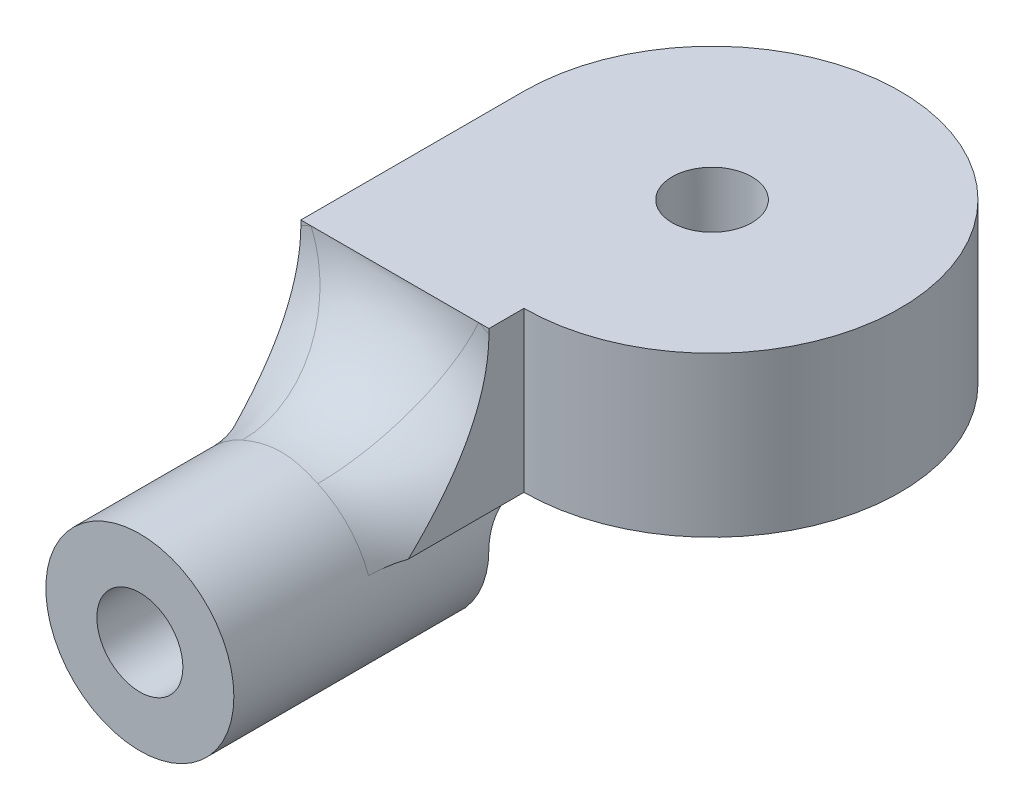
ISO-10303-21;
HEADER;
FILE_DESCRIPTION(('STEP AP214'),'2;1');
FILE_NAME('part.step','',(''),(''),'','','');
FILE_SCHEMA(('AUTOMOTIVE_DESIGN { 1 0 10303 214 1 1 1 1 }'));
ENDSEC;
DATA;
#1=APPLICATION_CONTEXT('core data for automotive mechanical design processes');
#2=APPLICATION_PROTOCOL_DEFINITION('international standard','automotive_design',2000,#1);
#3=PRODUCT_CONTEXT('',#1,'mechanical');
#4=PRODUCT('Part','Part','',(#3));
#5=PRODUCT_RELATED_PRODUCT_CATEGORY('part','',(#4));
#6=PRODUCT_DEFINITION_FORMATION('','',#4);
#7=PRODUCT_DEFINITION_CONTEXT('part definition',#1,'design');
#8=PRODUCT_DEFINITION('design','',#6,#7);
#9=PRODUCT_DEFINITION_SHAPE('','',#8);
#10=(LENGTH_UNIT() NAMED_UNIT(*) SI_UNIT(.MILLI.,.METRE.));
#11=(NAMED_UNIT(*) PLANE_ANGLE_UNIT() SI_UNIT($,.RADIAN.));
#12=(NAMED_UNIT(*) SI_UNIT($,.STERADIAN.) SOLID_ANGLE_UNIT());
#13=UNCERTAINTY_MEASURE_WITH_UNIT(LENGTH_MEASURE(1.E-05),#10,'distance_accuracy_value','');
#14=(GEOMETRIC_REPRESENTATION_CONTEXT(3) GLOBAL_UNCERTAINTY_ASSIGNED_CONTEXT((#13)) GLOBAL_UNIT_ASSIGNED_CONTEXT((#10,
#11,#12)) REPRESENTATION_CONTEXT('',''));
#15=CARTESIAN_POINT('',(0.,0.,0.));
#16=DIRECTION('',(0.,0.,1.));
#17=DIRECTION('',(1.,0.,0.));
#18=AXIS2_PLACEMENT_3D('',#15,#16,#17);
#19=CARTESIAN_POINT('',(0.,7.62,0.));
#20=DIRECTION('',(0.,0.,1.));
#21=DIRECTION('',(1.,0.,0.));
#22=AXIS2_PLACEMENT_3D('',#19,#20,#21);
#23=PLANE('',#22);
#24=DIRECTION('',(0.,-1.,0.));
#25=VECTOR('',#24,1.);
#26=CARTESIAN_POINT('',(-3.7465,7.62,0.));
#27=LINE('',#26,#25);
#28=CARTESIAN_POINT('',(-3.7465,7.62,0.));
#29=VERTEX_POINT('',#28);
#30=CARTESIAN_POINT('',(-3.7465,7.42705729074443,0.));
#31=VERTEX_POINT('',#30);
#32=EDGE_CURVE('E183',#29,#31,#27,.T.);
#33=ORIENTED_EDGE('',*,*,#32,.T.);
#34=CARTESIAN_POINT('',(0.,0.,0.));
#35=DIRECTION('',(0.,0.,1.));
#36=DIRECTION('',(1.,0.,0.));
#37=AXIS2_PLACEMENT_3D('',#34,#35,#36);
#38=CIRCLE('',#37,8.3185);
#39=CARTESIAN_POINT('',(-3.33662138247659,7.62,0.));
#40=VERTEX_POINT('',#39);
#41=EDGE_CURVE('E531',#31,#40,#38,.F.);
#42=ORIENTED_EDGE('',*,*,#41,.T.);
#43=DIRECTION('',(-1.,0.,0.));
#44=VECTOR('',#43,1.);
#45=CARTESIAN_POINT('',(0.,7.62,0.));
#46=LINE('',#45,#44);
#47=EDGE_CURVE('E172',#40,#29,#46,.T.);
#48=ORIENTED_EDGE('',*,*,#47,.T.);
#49=EDGE_LOOP('',(#33,#42,#48));
#50=FACE_BOUND('',#49,.T.);
#51=ADVANCED_FACE('F37',(#50),#23,.T.);
#52=CARTESIAN_POINT('',(0.,0.,0.));
#53=DIRECTION('',(0.,0.,1.));
#54=DIRECTION('',(1.,0.,0.));
#55=AXIS2_PLACEMENT_3D('',#52,#53,#54);
#56=PLANE('',#55);
#57=CARTESIAN_POINT('',(0.,0.,0.));
#58=DIRECTION('',(0.,0.,1.));
#59=DIRECTION('',(1.,0.,0.));
#60=AXIS2_PLACEMENT_3D('',#57,#58,#59);
#61=CIRCLE('',#60,3.7465);
#62=CARTESIAN_POINT('',(-3.7465,0.,0.));
#63=VERTEX_POINT('',#62);
#64=CARTESIAN_POINT('',(3.7465,0.,0.));
#65=VERTEX_POINT('',#64);
#66=EDGE_CURVE('E190',#63,#65,#61,.T.);
#67=ORIENTED_EDGE('',*,*,#66,.F.);
#68=DIRECTION('',(-1.,0.,0.));
#69=VECTOR('',#68,1.);
#70=CARTESIAN_POINT('',(-1.15178567884828,0.,0.));
#71=LINE('',#70,#69);
#72=CARTESIAN_POINT('',(-1.7145,0.,0.));
#73=VERTEX_POINT('',#72);
#74=EDGE_CURVE('E305',#63,#73,#71,.F.);
#75=ORIENTED_EDGE('',*,*,#74,.T.);
#76=CARTESIAN_POINT('',(0.,0.,0.));
#77=DIRECTION('',(0.,0.,1.));
#78=DIRECTION('',(1.,0.,0.));
#79=AXIS2_PLACEMENT_3D('',#76,#77,#78);
#80=CIRCLE('',#79,1.7145);
#81=CARTESIAN_POINT('',(1.7145,0.,0.));
#82=VERTEX_POINT('',#81);
#83=EDGE_CURVE('E149',#73,#82,#80,.T.);
#84=ORIENTED_EDGE('',*,*,#83,.T.);
#85=DIRECTION('',(-1.,0.,0.));
#86=VECTOR('',#85,1.);
#87=CARTESIAN_POINT('',(3.52467902793999,0.,0.));
#88=LINE('',#87,#86);
#89=EDGE_CURVE('E309',#82,#65,#88,.F.);
#90=ORIENTED_EDGE('',*,*,#89,.T.);
#91=EDGE_LOOP('',(#67,#75,#84,#90));
#92=FACE_BOUND('',#91,.T.);
#93=ADVANCED_FACE('F358',(#92),#56,.F.);
#94=CARTESIAN_POINT('',(0.,0.,10.16));
#95=DIRECTION('',(0.,0.,1.));
#96=DIRECTION('',(1.,0.,0.));
#97=AXIS2_PLACEMENT_3D('',#94,#95,#96);
#98=PLANE('',#97);
#99=CARTESIAN_POINT('',(0.,0.,10.16));
#100=DIRECTION('',(0.,0.,1.));
#101=DIRECTION('',(1.,0.,0.));
#102=AXIS2_PLACEMENT_3D('',#99,#100,#101);
#103=CIRCLE('',#102,3.7465);
#104=CARTESIAN_POINT('',(3.7465,0.,10.16));
#105=VERTEX_POINT('',#104);
#106=EDGE_CURVE('E194',#105,#105,#103,.T.);
#107=ORIENTED_EDGE('',*,*,#106,.T.);
#108=EDGE_LOOP('',(#107));
#109=FACE_BOUND('',#108,.T.);
#110=CARTESIAN_POINT('',(0.,0.,10.16));
#111=DIRECTION('',(0.,0.,1.));
#112=DIRECTION('',(1.,0.,0.));
#113=AXIS2_PLACEMENT_3D('',#110,#111,#112);
#114=CIRCLE('',#113,1.7145);
#115=CARTESIAN_POINT('',(1.7145,0.,10.16));
#116=VERTEX_POINT('',#115);
#117=EDGE_CURVE('E187',#116,#116,#114,.T.);
#118=ORIENTED_EDGE('',*,*,#117,.F.);
#119=EDGE_LOOP('',(#118));
#120=FACE_BOUND('',#119,.T.);
#121=ADVANCED_FACE('F292',(#109,#120),#98,.T.);
#122=CARTESIAN_POINT('',(0.,0.,10.16));
#123=DIRECTION('',(0.,0.,-1.));
#124=DIRECTION('',(-1.,0.,0.));
#125=AXIS2_PLACEMENT_3D('',#122,#123,#124);
#126=CYLINDRICAL_SURFACE('',#125,3.7465);
#127=ORIENTED_EDGE('',*,*,#106,.F.);
#128=EDGE_LOOP('',(#127));
#129=FACE_BOUND('',#128,.T.);
#130=CARTESIAN_POINT('',(0.,0.,4.572));
#131=DIRECTION('',(0.,0.,1.));
#132=DIRECTION('',(1.,0.,0.));
#133=AXIS2_PLACEMENT_3D('',#130,#131,#132);
#134=CIRCLE('',#133,3.7465);
#135=CARTESIAN_POINT('',(-1.5027531417261,3.43190839694656,4.572));
#136=VERTEX_POINT('',#135);
#137=CARTESIAN_POINT('',(-3.52467902793999,1.27,4.572));
#138=VERTEX_POINT('',#137);
#139=EDGE_CURVE('E213',#136,#138,#134,.T.);
#140=ORIENTED_EDGE('',*,*,#139,.T.);
#141=DIRECTION('',(0.,0.,-1.));
#142=VECTOR('',#141,1.);
#143=CARTESIAN_POINT('',(-3.52467902793999,1.27,4.572));
#144=LINE('',#143,#142);
#145=CARTESIAN_POINT('',(-3.52467902793999,1.27,-1.27));
#146=VERTEX_POINT('',#145);
#147=EDGE_CURVE('E530',#138,#146,#144,.T.);
#148=ORIENTED_EDGE('',*,*,#147,.T.);
#149=CARTESIAN_POINT('',(-3.52467902793999,1.27,-1.27));
#150=CARTESIAN_POINT('',(-3.52467551141979,1.2700009902898,-1.23537706976724));
#151=CARTESIAN_POINT('',(-3.5251898251675,1.26858324531154,-1.20077185710846));
#152=CARTESIAN_POINT('',(-3.52721846548378,1.26293533176767,-1.1318307135482));
#153=CARTESIAN_POINT('',(-3.52873251368593,1.25870594607407,-1.09749471038007));
#154=CARTESIAN_POINT('',(-3.53470538398453,1.24188141013375,-0.995483295649385));
#155=CARTESIAN_POINT('',(-3.54059549873313,1.2251494088276,-0.928525615265789));
#156=CARTESIAN_POINT('',(-3.55547625006654,1.18126176661794,-0.798587402711958));
#157=CARTESIAN_POINT('',(-3.56446511769491,1.15411207176918,-0.735604625641566));
#158=CARTESIAN_POINT('',(-3.58452374617743,1.09021571623752,-0.615028828309147));
#159=CARTESIAN_POINT('',(-3.59559491323332,1.05346256365739,-0.557439489899789));
#160=CARTESIAN_POINT('',(-3.61906738128541,0.969826608964907,-0.44701267291083));
#161=CARTESIAN_POINT('',(-3.63150248662518,0.92262298171232,-0.39442542955397));
#162=CARTESIAN_POINT('',(-3.65601756421701,0.820104914392189,-0.297738138240444));
#163=CARTESIAN_POINT('',(-3.66809746364169,0.764788824766774,-0.253639820617659));
#164=CARTESIAN_POINT('',(-3.6909390069222,0.645754920040908,-0.17402259835627));
#165=CARTESIAN_POINT('',(-3.70165542465871,0.581848326967486,-0.138772081287993));
#166=CARTESIAN_POINT('',(-3.72015079511388,0.448608604553651,-0.0796425699676043));
#167=CARTESIAN_POINT('',(-3.727932556751,0.379280741355271,-0.0557526960811878));
#168=CARTESIAN_POINT('',(-3.73794300200657,0.258044692354971,-0.0254120631196584));
#169=CARTESIAN_POINT('',(-3.74112963512447,0.206960099295953,-0.0159061848732914));
#170=CARTESIAN_POINT('',(-3.74541812740578,0.103928311432396,-0.00319151700517364));
#171=CARTESIAN_POINT('',(-3.74651995734204,0.0519811045450511,1.71843355921098E-05));
#172=CARTESIAN_POINT('',(-3.7465,0.,0.));
#173=B_SPLINE_CURVE_WITH_KNOTS('',3,(#149,#150,#151,#152,#153,#154,#155,#156,#157,#158,#159,
#160,#161,#162,#163,#164,#165,#166,#167,#168,#169,#170,#171,#172),.UNSPECIFIED.,.F.,.F.,(4,2,2,
2,2,2,2,2,2,2,2,4),(0.,0.103801405808098,0.207573921296298,0.414293544442592,0.620895354349748,
0.827637189168036,1.04192669238821,1.25625982900608,1.47646967744981,1.69646821289661,
1.85223702321786,2.00800801726778),.UNSPECIFIED.);
#174=EDGE_CURVE('E303',#146,#63,#173,.T.);
#175=ORIENTED_EDGE('',*,*,#174,.T.);
#176=ORIENTED_EDGE('',*,*,#66,.T.);
#177=CARTESIAN_POINT('',(3.7465,0.,0.));
#178=CARTESIAN_POINT('',(3.74650260117182,0.0346808764586416,8.36462003249203E-07));
#179=CARTESIAN_POINT('',(3.74601787439513,0.069344238595329,-0.0014215116955115));
#180=CARTESIAN_POINT('',(3.7441015662107,0.138405049822375,-0.00708876228888397));
#181=CARTESIAN_POINT('',(3.74267020737296,0.172802559496556,-0.0113330012493434));
#182=CARTESIAN_POINT('',(3.7370115851823,0.275020471103634,-0.0282218612655205));
#183=CARTESIAN_POINT('',(3.73141935821552,0.342127579497861,-0.0450230459974732));
#184=CARTESIAN_POINT('',(3.71718027089636,0.472373835625486,-0.0891117377810754));
#185=CARTESIAN_POINT('',(3.70853457486629,0.535514485020284,-0.116395248151192));
#186=CARTESIAN_POINT('',(3.68906617702462,0.65635469437696,-0.180605005794135));
#187=CARTESIAN_POINT('',(3.67824227601802,0.714051231307606,-0.217536568086225));
#188=CARTESIAN_POINT('',(3.65512669221314,0.82437393067404,-0.301361542531086));
#189=CARTESIAN_POINT('',(3.64279917395521,0.87677932311915,-0.348535427216729));
#190=CARTESIAN_POINT('',(3.61825816874598,0.97311129117496,-0.450917326756902));
#191=CARTESIAN_POINT('',(3.60604471852328,1.01703521973261,-0.506127840433574));
#192=CARTESIAN_POINT('',(3.58271257113477,1.09644992733464,-0.625048163284352));
#193=CARTESIAN_POINT('',(3.57163820647491,1.1316451676076,-0.688964668012461));
#194=CARTESIAN_POINT('',(3.55239948563874,1.190667461744,-0.82221850036134));
#195=CARTESIAN_POINT('',(3.54423198790606,1.21450679783531,-0.891549876473136));
#196=CARTESIAN_POINT('',(3.53370927691445,1.24472535838696,-1.01265221825444));
#197=CARTESIAN_POINT('',(3.53035102375469,1.25417794068246,-1.06358874757814));
#198=CARTESIAN_POINT('',(3.52582318061235,1.26682475319856,-1.1663379990158));
#199=CARTESIAN_POINT('',(3.5246540860093,1.27001756691859,-1.21815091676978));
#200=CARTESIAN_POINT('',(3.52467902793999,1.27,-1.27));
#201=B_SPLINE_CURVE_WITH_KNOTS('',3,(#177,#178,#179,#180,#181,#182,#183,#184,#185,#186,#187,
#188,#189,#190,#191,#192,#193,#194,#195,#196,#197,#198,#199,#200),.UNSPECIFIED.,.F.,.F.,(4,2,2,
2,2,2,2,2,2,2,2,4),(0.,0.103975807805818,0.207927177739375,0.4150563426526,0.622106611992641,
0.829271184753287,1.04305170250601,1.25689883340032,1.4772195223836,1.69730137456618,
1.85263679283544,2.0080073573441),.UNSPECIFIED.);
#202=CARTESIAN_POINT('',(3.52467902793999,1.27,-1.27));
#203=VERTEX_POINT('',#202);
#204=EDGE_CURVE('E11',#65,#203,#201,.T.);
#205=ORIENTED_EDGE('',*,*,#204,.T.);
#206=DIRECTION('',(0.,0.,-1.));
#207=VECTOR('',#206,1.);
#208=CARTESIAN_POINT('',(3.52467902793999,1.27,0.));
#209=LINE('',#208,#207);
#210=CARTESIAN_POINT('',(3.52467902793999,1.27,4.572));
#211=VERTEX_POINT('',#210);
#212=EDGE_CURVE('E197',#203,#211,#209,.F.);
#213=ORIENTED_EDGE('',*,*,#212,.T.);
#214=CARTESIAN_POINT('',(0.,0.,4.572));
#215=DIRECTION('',(0.,0.,1.));
#216=DIRECTION('',(1.,0.,0.));
#217=AXIS2_PLACEMENT_3D('',#214,#215,#216);
#218=CIRCLE('',#217,3.7465);
#219=CARTESIAN_POINT('',(1.5027531417261,3.43190839694657,4.572));
#220=VERTEX_POINT('',#219);
#221=EDGE_CURVE('E204',#211,#220,#218,.T.);
#222=ORIENTED_EDGE('',*,*,#221,.T.);
#223=CARTESIAN_POINT('',(2.02847506857651,3.14984938467914,4.52890429575409));
#224=CARTESIAN_POINT('',(1.70629066354551,3.3573332841533,-0.589450715656693));
#225=CARTESIAN_POINT('',(4.50390227090716,7.62,0.));
#226=CARTESIAN_POINT('',(1.94607245369308,3.2029357311331,4.54512957665234));
#227=CARTESIAN_POINT('',(1.69982969048028,3.35005406353562,-0.478285669951793));
#228=CARTESIAN_POINT('',(4.32094053278385,7.62,0.));
#229=CARTESIAN_POINT('',(1.8614631594562,3.25282897419113,4.55583455260318));
#230=CARTESIAN_POINT('',(1.67889729708073,3.35557034968474,-0.372623325720961));
#231=CARTESIAN_POINT('',(4.13307921846193,7.62,0.));
#232=CARTESIAN_POINT('',(1.68855358312247,3.3458398452382,4.56919401951259));
#233=CARTESIAN_POINT('',(1.61140738962111,3.38291169064701,-0.177820721524429));
#234=CARTESIAN_POINT('',(3.74916134558218,7.62,0.));
#235=CARTESIAN_POINT('',(1.60025631234802,3.38896286945571,4.57185495320795));
#236=CARTESIAN_POINT('',(1.56532120073966,3.40442364795939,-0.088176153833044));
#237=CARTESIAN_POINT('',(3.55311147318083,7.62,0.));
#238=CARTESIAN_POINT('',(1.42062218849538,3.46810225132448,4.57213276179));
#239=CARTESIAN_POINT('',(1.45102375269723,3.45463992355778,0.0730185975899158));
#240=CARTESIAN_POINT('',(3.15426282530197,7.62,0.));
#241=CARTESIAN_POINT('',(1.32928751581187,3.5041235834969,4.56975318122508));
#242=CARTESIAN_POINT('',(1.3830766460804,3.48327364808713,0.145082681130852));
#243=CARTESIAN_POINT('',(2.95146889103977,7.62,0.));
#244=CARTESIAN_POINT('',(1.14407575243789,3.56889014069538,4.562441890533));
#245=CARTESIAN_POINT('',(1.22951323452347,3.54102435806797,0.271844310173531));
#246=CARTESIAN_POINT('',(2.54023599270165,7.62,0.));
#247=CARTESIAN_POINT('',(1.05019814188851,3.59763386532445,4.55750965477152));
#248=CARTESIAN_POINT('',(1.14393286661081,3.57021522863332,0.326965415772105));
#249=CARTESIAN_POINT('',(2.33179587436277,7.62,0.));
#250=CARTESIAN_POINT('',(0.858769521923438,3.64811624169302,4.54708241450258));
#251=CARTESIAN_POINT('',(0.957825396404587,3.62471091487557,0.42179823199684));
#252=CARTESIAN_POINT('',(1.90675944698241,7.62,0.));
#253=CARTESIAN_POINT('',(0.761182795004,3.66971913747683,4.54157886136446));
#254=CARTESIAN_POINT('',(0.856893729837544,3.65008066101771,0.461566911417397));
#255=CARTESIAN_POINT('',(1.69008383297502,7.62,0.));
#256=CARTESIAN_POINT('',(0.56458372427859,3.70506168207007,4.53176757116625));
#257=CARTESIAN_POINT('',(0.645789044993283,3.69287637146484,0.525584600453253));
#258=CARTESIAN_POINT('',(1.25356725221191,7.62,0.));
#259=CARTESIAN_POINT('',(0.465571393247379,3.71880140129609,4.52745982339762));
#260=CARTESIAN_POINT('',(0.535326463486733,3.71043957696984,0.550068001907751));
#261=CARTESIAN_POINT('',(1.03372631382048,7.62,0.));
#262=CARTESIAN_POINT('',(0.266765042353368,3.73832487800842,4.52114944947836));
#263=CARTESIAN_POINT('',(0.309580809329482,3.73562482536011,0.58453269180036));
#264=CARTESIAN_POINT('',(0.592308822852361,7.62,0.));
#265=CARTESIAN_POINT('',(0.166971151151121,3.74410991841503,4.51914645162916));
#266=CARTESIAN_POINT('',(0.193915198631663,3.74333773767367,0.594642460799426));
#267=CARTESIAN_POINT('',(0.370732555945698,7.62,0.));
#268=CARTESIAN_POINT('',(-0.0327653325125049,3.74768811665468,4.517920352614));
#269=CARTESIAN_POINT('',(-0.0379483268517515,3.7480702399343,0.600886833964575));
#270=CARTESIAN_POINT('',(-0.0727501450701262,7.62,0.));
#271=CARTESIAN_POINT('',(-0.132707929284684,3.74548103810883,4.51869733367007));
#272=CARTESIAN_POINT('',(-0.154569505874384,3.74510689882468,0.597043854243316));
#273=CARTESIAN_POINT('',(-0.294656588750726,7.62,0.));
#274=CARTESIAN_POINT('',(-0.336942185241151,3.73278756768615,4.52295330031824));
#275=CARTESIAN_POINT('',(-0.389704175847612,3.7284728866973,0.57479251272231));
#276=CARTESIAN_POINT('',(-0.748125868925282,7.62,0.));
#277=CARTESIAN_POINT('',(-0.441208747230224,3.72190341199142,4.52656196425942));
#278=CARTESIAN_POINT('',(-0.508476172496318,3.71422238749317,0.555595652559002));
#279=CARTESIAN_POINT('',(-0.979632981138343,7.62,0.));
#280=CARTESIAN_POINT('',(-0.648452055395365,3.69144187440801,4.53566709494405));
#281=CARTESIAN_POINT('',(-0.737056319316469,3.67619651070218,0.501065727051287));
#282=CARTESIAN_POINT('',(-1.4397833772338,7.62,0.));
#283=CARTESIAN_POINT('',(-0.751428708895983,3.67186387153835,4.54116369653207));
#284=CARTESIAN_POINT('',(-0.847248413166816,3.65227935887497,0.465511835456308));
#285=CARTESIAN_POINT('',(-1.66842645534528,7.62,0.));
#286=CARTESIAN_POINT('',(-0.955344003727895,3.62416079317871,4.55234012482855));
#287=CARTESIAN_POINT('',(-1.05375412427631,3.59827790417947,0.377113332723662));
#288=CARTESIAN_POINT('',(-2.12118753370096,7.62,0.));
#289=CARTESIAN_POINT('',(-1.05628329905605,3.59603850849883,4.55801989116945));
#290=CARTESIAN_POINT('',(-1.15030418161015,3.56802759220772,0.323920451879797));
#291=CARTESIAN_POINT('',(-2.34530698603989,7.62,0.));
#292=CARTESIAN_POINT('',(-1.25547430403665,3.53143129394279,4.56722223982201));
#293=CARTESIAN_POINT('',(-1.32466166365388,3.50646996156692,0.198969646563733));
#294=CARTESIAN_POINT('',(-2.78757853947106,7.62,0.));
#295=CARTESIAN_POINT('',(-1.3537261250424,3.49494671114094,4.57074491164086));
#296=CARTESIAN_POINT('',(-1.40248817403093,3.47504253994331,0.126725381966055));
#297=CARTESIAN_POINT('',(-3.00573088780539,7.62,0.));
#298=CARTESIAN_POINT('',(-1.53149280816575,3.42031446732329,4.57255306060283));
#299=CARTESIAN_POINT('',(-1.52390607705249,3.42301403370248,-0.0237725394415804));
#300=CARTESIAN_POINT('',(-3.40043318423294,7.62,0.));
#301=CARTESIAN_POINT('',(-1.61150489158687,3.38335153356898,4.57158155256324));
#302=CARTESIAN_POINT('',(-1.57096273211064,3.40144439527557,-0.0998137121095394));
#303=CARTESIAN_POINT('',(-3.57808713216925,7.62,0.));
#304=CARTESIAN_POINT('',(-1.76865563528914,3.30391725215962,4.564012288366));
#305=CARTESIAN_POINT('',(-1.6457531358805,3.36848164127127,-0.265053551582832));
#306=CARTESIAN_POINT('',(-3.92701505462345,7.62,0.));
#307=CARTESIAN_POINT('',(-1.84579560648529,3.26144845821502,4.55741713269031));
#308=CARTESIAN_POINT('',(-1.67321516142549,3.35723694577907,-0.354616049828369));
#309=CARTESIAN_POINT('',(-4.09829193981703,7.62,0.));
#310=CARTESIAN_POINT('',(-1.99690753898651,3.17117787199631,4.53632480558877));
#311=CARTESIAN_POINT('',(-1.70667781419008,3.35200387831233,-0.545336469189568));
#312=CARTESIAN_POINT('',(-4.43381165436613,7.62,0.));
#313=CARTESIAN_POINT('',(-2.07087246311288,3.12336500253665,4.52181096944029));
#314=CARTESIAN_POINT('',(-1.71222581998939,3.35839035178787,-0.646844037978488));
#315=CARTESIAN_POINT('',(-4.59803885879951,7.62,0.));
#316=CARTESIAN_POINT('',(-2.2149846175485,3.02289225128455,4.48231966946328));
#317=CARTESIAN_POINT('',(-1.70136514488765,3.39642233052033,-0.856791352086905));
#318=CARTESIAN_POINT('',(-4.91801669323848,7.62,0.));
#319=CARTESIAN_POINT('',(-2.28512620683226,2.97022550042168,4.45732719351743));
#320=CARTESIAN_POINT('',(-1.68445987897611,3.42864228611855,-0.965413575997109));
#321=CARTESIAN_POINT('',(-5.07375479825524,7.62,0.));
#322=CARTESIAN_POINT('',(-2.353010468251,2.91540803084254,4.42583554068407));
#323=CARTESIAN_POINT('',(-1.65659529942642,3.4774810460628,-1.07339396679136));
#324=CARTESIAN_POINT('',(-5.22448087018443,7.62,0.));
#325=(BOUNDED_SURFACE() B_SPLINE_SURFACE(3,2,((#223,#224,#225),(#226,#227,#228),(#229,#230,
#231),(#232,#233,#234),(#235,#236,#237),(#238,#239,#240),(#241,#242,#243),(#244,#245,#246),
(#247,#248,#249),(#250,#251,#252),(#253,#254,#255),(#256,#257,#258),(#259,#260,#261),(#262,#263,
#264),(#265,#266,#267),(#268,#269,#270),(#271,#272,#273),(#274,#275,#276),(#277,#278,#279),
(#280,#281,#282),(#283,#284,#285),(#286,#287,#288),(#289,#290,#291),(#292,#293,#294),(#295,#296,
#297),(#298,#299,#300),(#301,#302,#303),(#304,#305,#306),(#307,#308,#309),(#310,#311,#312),
(#313,#314,#315),(#316,#317,#318),(#319,#320,#321),(#322,#323,#324)),.UNSPECIFIED.,.F.,.F.,
.F.) B_SPLINE_SURFACE_WITH_KNOTS((4,2,2,2,2,2,2,2,2,2,2,2,2,2,2,2,4),(3,3),(0.,
0.654316420569199,1.30810863866353,1.96144125508485,2.61490845715571,3.28016664818615,
3.94541888158026,4.61056381136662,5.27572841397161,5.97326968707715,6.6708607919246,
7.36822428780647,8.06555884509654,8.65212601474186,9.23842209153964,9.82595680414836,
10.414336134212),(0.,1.),
.UNSPECIFIED.) GEOMETRIC_REPRESENTATION_ITEM() RATIONAL_B_SPLINE_SURFACE(((1.,0.665145061768971,
1.),(1.,0.672570762917956,1.),(1.,0.67982125425068,1.),(1.,0.693715384382949,1.),(1.,
0.700359504705894,1.),(1.,0.712792789395896,1.),(1.,0.718582551494967,1.),(1.,0.729139685502109,
1.),(1.,0.733906846553469,1.),(1.,0.742359078006378,1.),(1.,0.746023071376118,1.),(1.,
0.752051940663699,1.),(1.,0.754416828215329,1.),(1.,0.757785016339958,1.),(1.,0.758788536472181,
1.),(1.,0.759408721499303,1.),(1.,0.759025345374668,1.),(1.,0.756829117290252,1.),(1.,
0.754947594363425,1.),(1.,0.749723521231599,1.),(1.,0.746380866661686,1.),(1.,0.738334261456984,
1.),(1.,0.733630755339657,1.),(1.,0.723007111356775,1.),(1.,0.717087023986058,1.),(1.,
0.705254482780663,1.),(1.,0.69949018853261,1.),(1.,0.687406008887464,1.),(1.,0.68108638149833,
1.),(1.,0.668072985989567,1.),(1.,0.661378455649391,1.),(1.,0.647880123696576,1.),(1.,
0.641076178834539,1.),(1.,0.63435404803645,1.))) REPRESENTATION_ITEM('') SURFACE());
#326=CARTESIAN_POINT('',(2.02847506857651,3.14984938467914,4.52890429575409));
#327=CARTESIAN_POINT('',(1.94607245369308,3.2029357311331,4.54512957665234));
#328=CARTESIAN_POINT('',(1.8614631594562,3.25282897419113,4.55583455260318));
#329=CARTESIAN_POINT('',(1.68855358312247,3.3458398452382,4.56919401951259));
#330=CARTESIAN_POINT('',(1.60025631234802,3.38896286945571,4.57185495320795));
#331=CARTESIAN_POINT('',(1.42062218849538,3.46810225132448,4.57213276179));
#332=CARTESIAN_POINT('',(1.32928751581187,3.5041235834969,4.56975318122508));
#333=CARTESIAN_POINT('',(1.14407575243789,3.56889014069538,4.562441890533));
#334=CARTESIAN_POINT('',(1.05019814188851,3.59763386532445,4.55750965477152));
#335=CARTESIAN_POINT('',(0.858769521923438,3.64811624169302,4.54708241450258));
#336=CARTESIAN_POINT('',(0.761182795004,3.66971913747683,4.54157886136446));
#337=CARTESIAN_POINT('',(0.56458372427859,3.70506168207007,4.53176757116625));
#338=CARTESIAN_POINT('',(0.465571393247379,3.71880140129609,4.52745982339762));
#339=CARTESIAN_POINT('',(0.266765042353368,3.73832487800842,4.52114944947836));
#340=CARTESIAN_POINT('',(0.166971151151121,3.74410991841503,4.51914645162916));
#341=CARTESIAN_POINT('',(-0.0327653325125049,3.74768811665469,4.517920352614));
#342=CARTESIAN_POINT('',(-0.132707929284684,3.74548103810883,4.51869733367007));
#343=CARTESIAN_POINT('',(-0.336942185241151,3.73278756768615,4.52295330031824));
#344=CARTESIAN_POINT('',(-0.441208747230224,3.72190341199142,4.52656196425942));
#345=CARTESIAN_POINT('',(-0.648452055395365,3.69144187440801,4.53566709494405));
#346=CARTESIAN_POINT('',(-0.751428708895983,3.67186387153835,4.54116369653207));
#347=CARTESIAN_POINT('',(-0.955344003727895,3.62416079317871,4.55234012482855));
#348=CARTESIAN_POINT('',(-1.05628329905605,3.59603850849883,4.55801989116945));
#349=CARTESIAN_POINT('',(-1.25547430403665,3.53143129394279,4.56722223982201));
#350=CARTESIAN_POINT('',(-1.3537261250424,3.49494671114094,4.57074491164087));
#351=CARTESIAN_POINT('',(-1.53149280816575,3.42031446732329,4.57255306060283));
#352=CARTESIAN_POINT('',(-1.61150489158687,3.38335153356898,4.57158155256324));
#353=CARTESIAN_POINT('',(-1.76865563528914,3.30391725215962,4.564012288366));
#354=CARTESIAN_POINT('',(-1.84579560648529,3.26144845821502,4.55741713269031));
#355=CARTESIAN_POINT('',(-1.99690753898651,3.17117787199631,4.53632480558876));
#356=CARTESIAN_POINT('',(-2.07087246311288,3.12336500253665,4.52181096944029));
#357=CARTESIAN_POINT('',(-2.2149846175485,3.02289225128455,4.48231966946328));
#358=CARTESIAN_POINT('',(-2.28512620683226,2.97022550042168,4.45732719351743));
#359=CARTESIAN_POINT('',(-2.353010468251,2.91540803084254,4.42583554068407));
#360=B_SPLINE_CURVE_WITH_KNOTS('',3,(#326,#327,#328,#329,#330,#331,#332,#333,#334,#335,#336,
#337,#338,#339,#340,#341,#342,#343,#344,#345,#346,#347,#348,#349,#350,#351,#352,#353,#354,#355,
#356,#357,#358,#359),.UNSPECIFIED.,.F.,.F.,(4,2,2,2,2,2,2,2,2,2,2,2,2,2,2,2,4),(0.,
0.654316420569199,1.30810863866353,1.96144125508485,2.61490845715571,3.28016664818615,
3.94541888158026,4.61056381136662,5.27572841397161,5.97326968707715,6.6708607919246,
7.36822428780647,8.06555884509654,8.65212601474186,9.23842209153964,9.82595680414836,
10.414336134212),.UNSPECIFIED.);
#361=EDGE_CURVE('E207',#220,#136,#360,.T.);
#362=ORIENTED_EDGE('',*,*,#361,.T.);
#363=EDGE_LOOP('',(#140,#148,#175,#176,#205,#213,#222,#362));
#364=FACE_BOUND('',#363,.T.);
#365=ADVANCED_FACE('F215',(#129,#364),#126,.T.);
#366=CARTESIAN_POINT('',(0.,0.,10.16));
#367=DIRECTION('',(0.,0.,-1.));
#368=DIRECTION('',(-1.,0.,0.));
#369=AXIS2_PLACEMENT_3D('',#366,#367,#368);
#370=CYLINDRICAL_SURFACE('',#369,1.7145);
#371=ORIENTED_EDGE('',*,*,#117,.T.);
#372=EDGE_LOOP('',(#371));
#373=FACE_BOUND('',#372,.T.);
#374=CARTESIAN_POINT('',(1.15178567884828,1.27,0.));
#375=VERTEX_POINT('',#374);
#376=CARTESIAN_POINT('',(-1.15178567884828,1.27,0.));
#377=VERTEX_POINT('',#376);
#378=EDGE_CURVE('E191',#375,#377,#80,.T.);
#379=ORIENTED_EDGE('',*,*,#378,.F.);
#380=DIRECTION('',(0.,0.,-1.));
#381=VECTOR('',#380,1.);
#382=CARTESIAN_POINT('',(1.15178567884828,1.27,-1.27));
#383=LINE('',#382,#381);
#384=CARTESIAN_POINT('',(1.15178567884828,1.27,-1.27));
#385=VERTEX_POINT('',#384);
#386=EDGE_CURVE('E319',#385,#375,#383,.F.);
#387=ORIENTED_EDGE('',*,*,#386,.F.);
#388=CARTESIAN_POINT('',(1.15178567884828,1.27,-1.27));
#389=CARTESIAN_POINT('',(1.15176709652935,1.2700065470563,-1.23990809004068));
#390=CARTESIAN_POINT('',(1.15296608038192,1.26892997580001,-1.20984255563327));
#391=CARTESIAN_POINT('',(1.15763197523181,1.26467962338882,-1.1500951881326));
#392=CARTESIAN_POINT('',(1.16109440452531,1.26150998645407,-1.12041271475183));
#393=CARTESIAN_POINT('',(1.17451524843893,1.24906870245116,-1.03303292638582));
#394=CARTESIAN_POINT('',(1.18751613903429,1.23686062444994,-0.976194972298672));
#395=CARTESIAN_POINT('',(1.21921276674955,1.20561703984832,-0.866737755900715));
#396=CARTESIAN_POINT('',(1.23786670333313,1.18663147084778,-0.814090994024549));
#397=CARTESIAN_POINT('',(1.27868868564185,1.14252932208814,-0.712691344724121));
#398=CARTESIAN_POINT('',(1.30086928110054,1.11739066718519,-0.66395333555731));
#399=CARTESIAN_POINT('',(1.35148374121443,1.05588249811342,-0.56128273176573));
#400=CARTESIAN_POINT('',(1.3802788258603,1.01827139106128,-0.508272757250304));
#401=CARTESIAN_POINT('',(1.43774258070263,0.935390902833199,-0.408519418650866));
#402=CARTESIAN_POINT('',(1.46641117672488,0.890117517753852,-0.361779353900476));
#403=CARTESIAN_POINT('',(1.5270030840932,0.782495567418301,-0.266642319543804));
#404=CARTESIAN_POINT('',(1.5584551337617,0.718540191411869,-0.219732543567538));
#405=CARTESIAN_POINT('',(1.61481656774958,0.580839594181832,-0.137788978388617));
#406=CARTESIAN_POINT('',(1.63973760183882,0.507112162743128,-0.102734010143002));
#407=CARTESIAN_POINT('',(1.67396041721541,0.374926276046182,-0.0552101404490289));
#408=CARTESIAN_POINT('',(1.68570118378181,0.31838141521007,-0.0391288858387321));
#409=CARTESIAN_POINT('',(1.70345834722685,0.202808372145792,-0.0149183163809121));
#410=CARTESIAN_POINT('',(1.70948984132605,0.143787172765354,-0.00676802780448771));
#411=CARTESIAN_POINT('',(1.71311352192964,0.0703779409547231,-0.00187246080360173));
#412=CARTESIAN_POINT('',(1.71363328727821,0.0563107610451696,-0.00117036130419834));
#413=CARTESIAN_POINT('',(1.71432601913164,0.028164063583309,-0.000234750573729945));
#414=CARTESIAN_POINT('',(1.71449927517991,0.0140845661749878,-8.48116760205194E-07));
#415=CARTESIAN_POINT('',(1.7145,0.,0.));
#416=B_SPLINE_CURVE_WITH_KNOTS('',3,(#388,#389,#390,#391,#392,#393,#394,#395,#396,#397,#398,
#399,#400,#401,#402,#403,#404,#405,#406,#407,#408,#409,#410,#411,#412,#413,#414,#415),
.UNSPECIFIED.,.F.,.F.,(4,2,2,2,2,2,2,2,2,2,2,2,2,4),(0.,0.0901859305075427,0.180193828290853,
0.357829439262193,0.534182339071857,0.711177452294949,0.92371989394891,1.13637374396515,
1.39091619845297,1.64500147113223,1.82411527617616,2.00275411043963,2.04503002200868,
2.08727059301339),.UNSPECIFIED.);
#417=EDGE_CURVE('E50',#385,#82,#416,.T.);
#418=ORIENTED_EDGE('',*,*,#417,.T.);
#419=ORIENTED_EDGE('',*,*,#83,.F.);
#420=CARTESIAN_POINT('',(-1.7145,0.,0.));
#421=CARTESIAN_POINT('',(-1.71450398504711,0.0312907341074102,3.05287612461261E-06));
#422=CARTESIAN_POINT('',(-1.71364254217327,0.0625634039284616,-0.00115732175113637));
#423=CARTESIAN_POINT('',(-1.71023325666738,0.124827943257971,-0.00576461304905331));
#424=CARTESIAN_POINT('',(-1.70768647831269,0.155819977473572,-0.00921008669895939));
#425=CARTESIAN_POINT('',(-1.69763392569646,0.247603615787678,-0.0228470051286665));
#426=CARTESIAN_POINT('',(-1.68771448267587,0.307681691090349,-0.0363403509472621));
#427=CARTESIAN_POINT('',(-1.66231516981742,0.423989197483805,-0.0713238008550541));
#428=CARTESIAN_POINT('',(-1.64684719263383,0.480226556146069,-0.0927968049648212));
#429=CARTESIAN_POINT('',(-1.61150055798008,0.588048195904404,-0.142775052565597));
#430=CARTESIAN_POINT('',(-1.59161575721141,0.639625853938957,-0.171290096970781));
#431=CARTESIAN_POINT('',(-1.54676341145403,0.741909900352714,-0.237281326658746));
#432=CARTESIAN_POINT('',(-1.52149777739604,0.792108304484139,-0.275337423935762));
#433=CARTESIAN_POINT('',(-1.46891302153365,0.885832179544782,-0.357802395240994));
#434=CARTESIAN_POINT('',(-1.44159117820265,0.92934856642336,-0.402219761568158));
#435=CARTESIAN_POINT('',(-1.38124951939516,1.01736694373678,-0.506200213269284));
#436=CARTESIAN_POINT('',(-1.34817415960885,1.06035322180074,-0.567020080459156));
#437=CARTESIAN_POINT('',(-1.28539259715785,1.13563565774969,-0.696565850493239));
#438=CARTESIAN_POINT('',(-1.25568220104417,1.16794521958655,-0.765281693160074));
#439=CARTESIAN_POINT('',(-1.21322811593876,1.21168964541925,-0.886128321759035));
#440=CARTESIAN_POINT('',(-1.19812510198124,1.22649386191284,-0.93620363575356));
#441=CARTESIAN_POINT('',(-1.17366481826431,1.24992563449916,-1.03904275642163));
#442=CARTESIAN_POINT('',(-1.16428545228669,1.25857696557987,-1.09179536143404));
#443=CARTESIAN_POINT('',(-1.15629955163199,1.26589441099465,-1.16586033626793));
#444=CARTESIAN_POINT('',(-1.15461416583502,1.26743020208855,-1.1866037042055));
#445=CARTESIAN_POINT('',(-1.1523553083099,1.26948383740538,-1.22822778807404));
#446=CARTESIAN_POINT('',(-1.15178327976082,1.27000036042345,-1.24910864711527));
#447=CARTESIAN_POINT('',(-1.15178567884828,1.27,-1.27));
#448=B_SPLINE_CURVE_WITH_KNOTS('',3,(#420,#421,#422,#423,#424,#425,#426,#427,#428,#429,#430,
#431,#432,#433,#434,#435,#436,#437,#438,#439,#440,#441,#442,#443,#444,#445,#446,#447),
.UNSPECIFIED.,.F.,.F.,(4,2,2,2,2,2,2,2,2,2,2,2,2,4),(0.,0.0938044276884722,0.187549675003768,
0.373624568092543,0.559302990751013,0.745241306372945,0.948128699420691,1.15128951675848,
1.39473671794624,1.63787711479868,1.80039902076027,1.96228947266035,2.02484825714525,
2.08748807901417),.UNSPECIFIED.);
#449=CARTESIAN_POINT('',(-1.15178567884828,1.27,-1.27));
#450=VERTEX_POINT('',#449);
#451=EDGE_CURVE('E295',#73,#450,#448,.T.);
#452=ORIENTED_EDGE('',*,*,#451,.T.);
#453=DIRECTION('',(0.,0.,-1.));
#454=VECTOR('',#453,1.);
#455=CARTESIAN_POINT('',(-1.15178567884828,1.27,0.));
#456=LINE('',#455,#454);
#457=EDGE_CURVE('E57',#377,#450,#456,.T.);
#458=ORIENTED_EDGE('',*,*,#457,.F.);
#459=EDGE_LOOP('',(#379,#387,#418,#419,#452,#458));
#460=FACE_BOUND('',#459,.T.);
#461=ADVANCED_FACE('F287',(#373,#460),#370,.F.);
#462=CARTESIAN_POINT('',(3.7465,7.62,0.));
#463=VERTEX_POINT('',#462);
#464=CARTESIAN_POINT('',(3.33662138247659,7.62,0.));
#465=VERTEX_POINT('',#464);
#466=EDGE_CURVE('E162',#463,#465,#46,.T.);
#467=ORIENTED_EDGE('',*,*,#466,.T.);
#468=CARTESIAN_POINT('',(0.,0.,0.));
#469=DIRECTION('',(0.,0.,1.));
#470=DIRECTION('',(1.,0.,0.));
#471=AXIS2_PLACEMENT_3D('',#468,#469,#470);
#472=CIRCLE('',#471,8.3185);
#473=CARTESIAN_POINT('',(3.7465,7.42705729074443,0.));
#474=VERTEX_POINT('',#473);
#475=EDGE_CURVE('E519',#465,#474,#472,.F.);
#476=ORIENTED_EDGE('',*,*,#475,.T.);
#477=DIRECTION('',(0.,-1.,0.));
#478=VECTOR('',#477,1.);
#479=CARTESIAN_POINT('',(3.7465,7.62,0.));
#480=LINE('',#479,#478);
#481=EDGE_CURVE('E174',#463,#474,#480,.T.);
#482=ORIENTED_EDGE('',*,*,#481,.F.);
#483=EDGE_LOOP('',(#467,#476,#482));
#484=FACE_BOUND('',#483,.T.);
#485=ADVANCED_FACE('F286',(#484),#23,.T.);
#486=CARTESIAN_POINT('',(3.7465,7.62,0.));
#487=DIRECTION('',(1.,0.,0.));
#488=DIRECTION('',(0.,0.,-1.));
#489=AXIS2_PLACEMENT_3D('',#486,#487,#488);
#490=PLANE('',#489);
#491=DIRECTION('',(0.,0.,1.));
#492=VECTOR('',#491,1.);
#493=CARTESIAN_POINT('',(3.7465,1.27,0.));
#494=LINE('',#493,#492);
#495=CARTESIAN_POINT('',(3.7465,1.27,-1.397));
#496=VERTEX_POINT('',#495);
#497=CARTESIAN_POINT('',(3.7465,1.27,3.20418258785179));
#498=VERTEX_POINT('',#497);
#499=EDGE_CURVE('E145',#496,#498,#494,.T.);
#500=ORIENTED_EDGE('',*,*,#499,.F.);
#501=DIRECTION('',(0.,-1.,0.));
#502=VECTOR('',#501,1.);
#503=CARTESIAN_POINT('',(3.7465,7.62,-1.397));
#504=LINE('',#503,#502);
#505=CARTESIAN_POINT('',(3.7465,7.62,-1.397));
#506=VERTEX_POINT('',#505);
#507=EDGE_CURVE('E137',#506,#496,#504,.T.);
#508=ORIENTED_EDGE('',*,*,#507,.F.);
#509=DIRECTION('',(0.,0.,1.));
#510=VECTOR('',#509,1.);
#511=CARTESIAN_POINT('',(3.7465,7.62,0.));
#512=LINE('',#511,#510);
#513=EDGE_CURVE('E142',#506,#463,#512,.T.);
#514=ORIENTED_EDGE('',*,*,#513,.T.);
#515=ORIENTED_EDGE('',*,*,#481,.T.);
#516=CARTESIAN_POINT('',(3.7465,7.42705729074443,0.));
#517=CARTESIAN_POINT('',(3.7465,7.24884383493951,-2.69018010356427E-05));
#518=CARTESIAN_POINT('',(3.7465,7.07071058660268,0.00830303520387213));
#519=CARTESIAN_POINT('',(3.7465,6.7160965784259,0.0407180672741597));
#520=CARTESIAN_POINT('',(3.7465,6.53961402622074,0.0647833888439291));
#521=CARTESIAN_POINT('',(3.7465,6.19177606485833,0.127277670185252));
#522=CARTESIAN_POINT('',(3.7465,6.02038348463429,0.165502190547611));
#523=CARTESIAN_POINT('',(3.7465,5.68109328662484,0.255316491789867));
#524=CARTESIAN_POINT('',(3.7465,5.51319708012032,0.306911560782923));
#525=CARTESIAN_POINT('',(3.7465,5.1292148505755,0.44065130973575));
#526=CARTESIAN_POINT('',(3.7465,4.91469112038889,0.527296698693158));
#527=CARTESIAN_POINT('',(3.7465,4.49419331478324,0.719259784273184));
#528=CARTESIAN_POINT('',(3.7465,4.2882215307905,0.824582445983218));
#529=CARTESIAN_POINT('',(3.7465,3.88372502157425,1.0522079601477));
#530=CARTESIAN_POINT('',(3.7465,3.68527467333536,1.17464220860413));
#531=CARTESIAN_POINT('',(3.7465,3.29752682163004,1.43326887788611));
#532=CARTESIAN_POINT('',(3.7465,3.10823277984454,1.56946644294975));
#533=CARTESIAN_POINT('',(3.7465,2.62637235407457,1.93903294018875));
#534=CARTESIAN_POINT('',(3.7465,2.3406471654312,2.18132022311414));
#535=CARTESIAN_POINT('',(3.7465,1.92776759302216,2.55778534710758));
#536=CARTESIAN_POINT('',(3.7465,1.79362409008673,2.68453598393742));
#537=CARTESIAN_POINT('',(3.7465,1.52916451852243,2.94177207196913));
#538=CARTESIAN_POINT('',(3.7465,1.39884551796611,3.07225450229745));
#539=CARTESIAN_POINT('',(3.7465,1.27000000000101,3.20418258785311));
#540=B_SPLINE_CURVE_WITH_KNOTS('',3,(#516,#517,#518,#519,#520,#521,#522,#523,#524,#525,#526,
#527,#528,#529,#530,#531,#532,#533,#534,#535,#536,#537,#538,#539),.UNSPECIFIED.,.F.,.F.,(4,2,2,
2,2,2,2,2,2,2,2,4),(0.,0.534327902750811,1.06798564219171,1.59422074033876,2.12066428536644,
2.81368940380036,3.50689903004092,4.20575846197147,4.90488007566193,6.02716257247226,
6.58078259575352,7.13396648819981),.UNSPECIFIED.);
#541=EDGE_CURVE('E269',#474,#498,#540,.T.);
#542=ORIENTED_EDGE('',*,*,#541,.T.);
#543=EDGE_LOOP('',(#500,#508,#514,#515,#542));
#544=FACE_BOUND('',#543,.T.);
#545=ADVANCED_FACE('F139',(#544),#490,.T.);
#546=CARTESIAN_POINT('',(3.7465,7.62,-8.89));
#547=DIRECTION('',(0.,-1.,0.));
#548=DIRECTION('',(0.,0.,-1.));
#549=AXIS2_PLACEMENT_3D('',#546,#547,#548);
#550=CYLINDRICAL_SURFACE('',#549,7.493);
#551=CARTESIAN_POINT('',(3.7465,1.27,-8.89));
#552=DIRECTION('',(0.,1.,0.));
#553=DIRECTION('',(0.,0.,1.));
#554=AXIS2_PLACEMENT_3D('',#551,#552,#553);
#555=CIRCLE('',#554,7.493);
#556=CARTESIAN_POINT('',(-3.7465,1.27,-8.89));
#557=VERTEX_POINT('',#556);
#558=EDGE_CURVE('E177',#496,#557,#555,.T.);
#559=ORIENTED_EDGE('',*,*,#558,.T.);
#560=DIRECTION('',(0.,-1.,0.));
#561=VECTOR('',#560,1.);
#562=CARTESIAN_POINT('',(-3.7465,7.62,-8.89));
#563=LINE('',#562,#561);
#564=CARTESIAN_POINT('',(-3.7465,7.62,-8.89));
#565=VERTEX_POINT('',#564);
#566=EDGE_CURVE('E150',#565,#557,#563,.T.);
#567=ORIENTED_EDGE('',*,*,#566,.F.);
#568=CARTESIAN_POINT('',(3.7465,7.62,-8.89));
#569=DIRECTION('',(0.,1.,0.));
#570=DIRECTION('',(0.,0.,1.));
#571=AXIS2_PLACEMENT_3D('',#568,#569,#570);
#572=CIRCLE('',#571,7.493);
#573=EDGE_CURVE('E153',#506,#565,#572,.T.);
#574=ORIENTED_EDGE('',*,*,#573,.F.);
#575=ORIENTED_EDGE('',*,*,#507,.T.);
#576=EDGE_LOOP('',(#559,#567,#574,#575));
#577=FACE_BOUND('',#576,.T.);
#578=ADVANCED_FACE('F154',(#577),#550,.T.);
#579=CARTESIAN_POINT('',(-3.7465,7.62,0.));
#580=DIRECTION('',(-1.,0.,0.));
#581=DIRECTION('',(0.,0.,1.));
#582=AXIS2_PLACEMENT_3D('',#579,#580,#581);
#583=PLANE('',#582);
#584=DIRECTION('',(0.,0.,-1.));
#585=VECTOR('',#584,1.);
#586=CARTESIAN_POINT('',(-3.7465,1.27,0.));
#587=LINE('',#586,#585);
#588=CARTESIAN_POINT('',(-3.7465,1.27,3.20418258785179));
#589=VERTEX_POINT('',#588);
#590=EDGE_CURVE('E165',#589,#557,#587,.T.);
#591=ORIENTED_EDGE('',*,*,#590,.F.);
#592=CARTESIAN_POINT('',(-3.7465,1.27,3.20418258785179));
#593=CARTESIAN_POINT('',(-3.7465,1.48838475554214,2.98051010371764));
#594=CARTESIAN_POINT('',(-3.7465,1.71131953407618,2.76079161736588));
#595=CARTESIAN_POINT('',(-3.7465,2.17032688217616,2.33337296550144));
#596=CARTESIAN_POINT('',(-3.7465,2.406456557952,2.12573450124195));
#597=CARTESIAN_POINT('',(-3.7465,2.898814768892,1.72478202221971));
#598=CARTESIAN_POINT('',(-3.7465,3.15535329679466,1.53184283144046));
#599=CARTESIAN_POINT('',(-3.7465,3.68542743708692,1.17168635000055));
#600=CARTESIAN_POINT('',(-3.7465,3.95892758528746,1.00441777317079));
#601=CARTESIAN_POINT('',(-3.7465,4.40956284226211,0.762864363363191));
#602=CARTESIAN_POINT('',(-3.7465,4.58118771335236,0.67824823587246));
#603=CARTESIAN_POINT('',(-3.7465,4.93031742809317,0.521906455134719));
#604=CARTESIAN_POINT('',(-3.7465,5.10782393932327,0.450184495362888));
#605=CARTESIAN_POINT('',(-3.7465,5.46650717101205,0.32169582067244));
#606=CARTESIAN_POINT('',(-3.7465,5.64764037446334,0.264808206999206));
#607=CARTESIAN_POINT('',(-3.7465,6.01401245433528,0.166618236221041));
#608=CARTESIAN_POINT('',(-3.7465,6.19924906413004,0.125307491417507));
#609=CARTESIAN_POINT('',(-3.7465,6.55733294733481,0.0622487526616257));
#610=CARTESIAN_POINT('',(-3.7465,6.72994436440701,0.0391699638415917));
#611=CARTESIAN_POINT('',(-3.7465,7.07735826527761,0.00799660589040697));
#612=CARTESIAN_POINT('',(-3.7465,7.25216734459287,-2.38737817095661E-05));
#613=CARTESIAN_POINT('',(-3.7465,7.42705729074443,0.));
#614=B_SPLINE_CURVE_WITH_KNOTS('',3,(#592,#593,#594,#595,#596,#597,#598,#599,#600,#601,#602,
#603,#604,#605,#606,#607,#608,#609,#610,#611,#612,#613),.UNSPECIFIED.,.F.,.F.,(4,2,2,2,2,2,2,2,
2,2,4),(0.,0.938294856919152,1.88102377845083,2.8428267495845,3.80268243634182,4.37628591055355,
4.95005342996305,5.51898730502329,6.08761438647221,6.60941716337685,7.13378063875116),.UNSPECIFIED.);
#615=EDGE_CURVE('E263',#589,#31,#614,.T.);
#616=ORIENTED_EDGE('',*,*,#615,.T.);
#617=ORIENTED_EDGE('',*,*,#32,.F.);
#618=DIRECTION('',(0.,0.,-1.));
#619=VECTOR('',#618,1.);
#620=CARTESIAN_POINT('',(-3.7465,7.62,0.));
#621=LINE('',#620,#619);
#622=EDGE_CURVE('E158',#29,#565,#621,.T.);
#623=ORIENTED_EDGE('',*,*,#622,.T.);
#624=ORIENTED_EDGE('',*,*,#566,.T.);
#625=EDGE_LOOP('',(#591,#616,#617,#623,#624));
#626=FACE_BOUND('',#625,.T.);
#627=ADVANCED_FACE('F275',(#626),#583,.T.);
#628=DIRECTION('',(-1.,0.,0.));
#629=VECTOR('',#628,1.);
#630=CARTESIAN_POINT('',(0.,1.27,0.));
#631=LINE('',#630,#629);
#632=EDGE_CURVE('E163',#375,#377,#631,.T.);
#633=ORIENTED_EDGE('',*,*,#632,.F.);
#634=ORIENTED_EDGE('',*,*,#378,.T.);
#635=EDGE_LOOP('',(#633,#634));
#636=FACE_BOUND('',#635,.T.);
#637=ADVANCED_FACE('F279',(#636),#23,.T.);
#638=CARTESIAN_POINT('',(0.,7.62,0.));
#639=DIRECTION('',(0.,1.,0.));
#640=DIRECTION('',(0.,0.,1.));
#641=AXIS2_PLACEMENT_3D('',#638,#639,#640);
#642=PLANE('',#641);
#643=CARTESIAN_POINT('',(3.7465,7.62,-8.89));
#644=DIRECTION('',(0.,1.,0.));
#645=DIRECTION('',(0.,0.,1.));
#646=AXIS2_PLACEMENT_3D('',#643,#644,#645);
#647=CIRCLE('',#646,1.5875);
#648=CARTESIAN_POINT('',(3.7465,7.62,-7.3025));
#649=VERTEX_POINT('',#648);
#650=EDGE_CURVE('E522',#649,#649,#647,.T.);
#651=ORIENTED_EDGE('',*,*,#650,.F.);
#652=EDGE_LOOP('',(#651));
#653=FACE_BOUND('',#652,.T.);
#654=ORIENTED_EDGE('',*,*,#513,.F.);
#655=ORIENTED_EDGE('',*,*,#573,.T.);
#656=ORIENTED_EDGE('',*,*,#622,.F.);
#657=ORIENTED_EDGE('',*,*,#47,.F.);
#658=EDGE_CURVE('E175',#465,#40,#46,.T.);
#659=ORIENTED_EDGE('',*,*,#658,.F.);
#660=ORIENTED_EDGE('',*,*,#466,.F.);
#661=EDGE_LOOP('',(#654,#655,#656,#657,#659,#660));
#662=FACE_BOUND('',#661,.T.);
#663=ADVANCED_FACE('F160',(#653,#662),#642,.T.);
#664=CARTESIAN_POINT('',(0.,1.27,0.));
#665=DIRECTION('',(0.,1.,0.));
#666=DIRECTION('',(0.,0.,1.));
#667=AXIS2_PLACEMENT_3D('',#664,#665,#666);
#668=PLANE('',#667);
#669=CARTESIAN_POINT('',(3.7465,1.27,-8.89));
#670=DIRECTION('',(0.,1.,0.));
#671=DIRECTION('',(0.,0.,1.));
#672=AXIS2_PLACEMENT_3D('',#669,#670,#671);
#673=CIRCLE('',#672,4.76250000000001);
#674=CARTESIAN_POINT('',(3.7465,1.27,-4.12749999999999));
#675=VERTEX_POINT('',#674);
#676=EDGE_CURVE('E178',#675,#675,#673,.F.);
#677=ORIENTED_EDGE('',*,*,#676,.F.);
#678=EDGE_LOOP('',(#677));
#679=FACE_BOUND('',#678,.T.);
#680=DIRECTION('',(-1.,0.,0.));
#681=VECTOR('',#680,1.);
#682=CARTESIAN_POINT('',(-3.52467902793999,1.27,-1.27));
#683=LINE('',#682,#681);
#684=EDGE_CURVE('E316',#450,#146,#683,.T.);
#685=ORIENTED_EDGE('',*,*,#684,.T.);
#686=ORIENTED_EDGE('',*,*,#147,.F.);
#687=CARTESIAN_POINT('',(-3.52467902793999,1.27,4.572));
#688=CARTESIAN_POINT('',(-3.5246612837029,1.27,4.45565636734503));
#689=CARTESIAN_POINT('',(-3.52939923414271,1.27,4.33931836668269));
#690=CARTESIAN_POINT('',(-3.54819222320417,1.27,4.1081414411931));
#691=CARTESIAN_POINT('',(-3.56218782248687,1.27,3.99329768808769));
#692=CARTESIAN_POINT('',(-3.59930487725891,1.27,3.76510142054007));
#693=CARTESIAN_POINT('',(-3.62242609395677,1.27,3.65174886715758));
#694=CARTESIAN_POINT('',(-3.67770855637114,1.27,3.42649902513085));
#695=CARTESIAN_POINT('',(-3.70992670901418,1.27,3.31461569236563));
#696=CARTESIAN_POINT('',(-3.74650000000078,1.27,3.20418258785179));
#697=B_SPLINE_CURVE_WITH_KNOTS('',3,(#687,#688,#689,#690,#691,#692,#693,#694,#695,#696),
.UNSPECIFIED.,.F.,.F.,(4,2,2,2,4),(0.,0.348925680052669,0.695632527295864,1.04233030280727,
1.39124685629217),.UNSPECIFIED.);
#698=EDGE_CURVE('E256',#138,#589,#697,.T.);
#699=ORIENTED_EDGE('',*,*,#698,.T.);
#700=ORIENTED_EDGE('',*,*,#590,.T.);
#701=ORIENTED_EDGE('',*,*,#558,.F.);
#702=ORIENTED_EDGE('',*,*,#499,.T.);
#703=CARTESIAN_POINT('',(3.7465,1.27,3.20418258785179));
#704=CARTESIAN_POINT('',(3.70992670901387,1.27,3.31461569236574));
#705=CARTESIAN_POINT('',(3.67770855637103,1.27,3.42649902513098));
#706=CARTESIAN_POINT('',(3.62242609395682,1.27,3.65174886715771));
#707=CARTESIAN_POINT('',(3.59930487725892,1.27,3.76510142054016));
#708=CARTESIAN_POINT('',(3.56218782248685,1.27,3.99329768808775));
#709=CARTESIAN_POINT('',(3.54819222320415,1.27,4.10814144119315));
#710=CARTESIAN_POINT('',(3.52939923414272,1.27,4.33931836668273));
#711=CARTESIAN_POINT('',(3.52466128370292,1.27,4.45565636734505));
#712=CARTESIAN_POINT('',(3.52467902793999,1.27,4.572));
#713=B_SPLINE_CURVE_WITH_KNOTS('',3,(#703,#704,#705,#706,#707,#708,#709,#710,#711,#712),
.UNSPECIFIED.,.F.,.F.,(4,2,2,2,4),(0.,0.34891655348481,0.695614328996158,1.04232117623934,
1.39124685629196),.UNSPECIFIED.);
#714=EDGE_CURVE('E322',#498,#211,#713,.T.);
#715=ORIENTED_EDGE('',*,*,#714,.T.);
#716=ORIENTED_EDGE('',*,*,#212,.F.);
#717=DIRECTION('',(-1.,0.,0.));
#718=VECTOR('',#717,1.);
#719=CARTESIAN_POINT('',(1.15178567884828,1.27,-1.27));
#720=LINE('',#719,#718);
#721=EDGE_CURVE('E243',#203,#385,#720,.T.);
#722=ORIENTED_EDGE('',*,*,#721,.T.);
#723=ORIENTED_EDGE('',*,*,#386,.T.);
#724=ORIENTED_EDGE('',*,*,#632,.T.);
#725=ORIENTED_EDGE('',*,*,#457,.T.);
#726=EDGE_LOOP('',(#685,#686,#699,#700,#701,#702,#715,#716,#722,#723,#724,#725));
#727=FACE_BOUND('',#726,.T.);
#728=ADVANCED_FACE('F330',(#679,#727),#668,.F.);
#729=CARTESIAN_POINT('',(3.7465,5.23875,-8.89));
#730=DIRECTION('',(0.,-1.,0.));
#731=DIRECTION('',(0.,0.,-1.));
#732=AXIS2_PLACEMENT_3D('',#729,#730,#731);
#733=CYLINDRICAL_SURFACE('',#732,4.76250000000001);
#734=CARTESIAN_POINT('',(3.7465,5.23875,-8.89));
#735=DIRECTION('',(0.,1.,0.));
#736=DIRECTION('',(0.,0.,1.));
#737=AXIS2_PLACEMENT_3D('',#734,#735,#736);
#738=CIRCLE('',#737,4.76250000000001);
#739=CARTESIAN_POINT('',(3.7465,5.23875,-4.12749999999999));
#740=VERTEX_POINT('',#739);
#741=EDGE_CURVE('E168',#740,#740,#738,.T.);
#742=ORIENTED_EDGE('',*,*,#741,.T.);
#743=EDGE_LOOP('',(#742));
#744=FACE_BOUND('',#743,.T.);
#745=ORIENTED_EDGE('',*,*,#676,.T.);
#746=EDGE_LOOP('',(#745));
#747=FACE_BOUND('',#746,.T.);
#748=ADVANCED_FACE('F333',(#744,#747),#733,.F.);
#749=CARTESIAN_POINT('',(0.,5.23875,0.));
#750=DIRECTION('',(0.,1.,0.));
#751=DIRECTION('',(0.,0.,1.));
#752=AXIS2_PLACEMENT_3D('',#749,#750,#751);
#753=PLANE('',#752);
#754=CARTESIAN_POINT('',(3.7465,5.23875,-8.89));
#755=DIRECTION('',(0.,-1.,0.));
#756=DIRECTION('',(0.,0.,-1.));
#757=AXIS2_PLACEMENT_3D('',#754,#755,#756);
#758=CIRCLE('',#757,1.5875);
#759=CARTESIAN_POINT('',(3.7465,5.23875,-10.4775));
#760=VERTEX_POINT('',#759);
#761=EDGE_CURVE('E540',#760,#760,#758,.T.);
#762=ORIENTED_EDGE('',*,*,#761,.F.);
#763=EDGE_LOOP('',(#762));
#764=FACE_BOUND('',#763,.T.);
#765=ORIENTED_EDGE('',*,*,#741,.F.);
#766=EDGE_LOOP('',(#765));
#767=FACE_BOUND('',#766,.T.);
#768=ADVANCED_FACE('F250',(#764,#767),#753,.F.);
#769=CARTESIAN_POINT('',(0.,0.,4.572));
#770=DIRECTION('',(0.,0.,1.));
#771=DIRECTION('',(1.,0.,0.));
#772=AXIS2_PLACEMENT_3D('',#769,#770,#771);
#773=TOROIDAL_SURFACE('',#772,8.3185,4.572);
#774=ORIENTED_EDGE('',*,*,#698,.F.);
#775=ORIENTED_EDGE('',*,*,#139,.F.);
#776=CARTESIAN_POINT('',(-3.33662138247659,7.62,4.572));
#777=DIRECTION('',(-0.916030534351145,-0.401108539096783,0.));
#778=DIRECTION('',(0.401108539096783,-0.916030534351145,0.));
#779=AXIS2_PLACEMENT_3D('',#776,#777,#778);
#780=CIRCLE('',#779,4.572);
#781=EDGE_CURVE('E521',#40,#136,#780,.T.);
#782=ORIENTED_EDGE('',*,*,#781,.F.);
#783=ORIENTED_EDGE('',*,*,#41,.F.);
#784=ORIENTED_EDGE('',*,*,#615,.F.);
#785=EDGE_LOOP('',(#774,#775,#782,#783,#784));
#786=FACE_BOUND('',#785,.T.);
#787=ADVANCED_FACE('F228',(#786),#773,.F.);
#788=ORIENTED_EDGE('',*,*,#781,.T.);
#789=ORIENTED_EDGE('',*,*,#361,.F.);
#790=CARTESIAN_POINT('',(3.33662138247659,7.62,4.572));
#791=DIRECTION('',(0.916030534351145,-0.401108539096783,0.));
#792=DIRECTION('',(0.401108539096783,0.916030534351145,0.));
#793=AXIS2_PLACEMENT_3D('',#790,#791,#792);
#794=CIRCLE('',#793,4.572);
#795=EDGE_CURVE('E329',#465,#220,#794,.F.);
#796=ORIENTED_EDGE('',*,*,#795,.F.);
#797=ORIENTED_EDGE('',*,*,#658,.T.);
#798=EDGE_LOOP('',(#788,#789,#796,#797));
#799=FACE_BOUND('',#798,.T.);
#800=ADVANCED_FACE('F223',(#799),#325,.F.);
#801=CARTESIAN_POINT('',(0.,0.,4.572));
#802=DIRECTION('',(0.,0.,1.));
#803=DIRECTION('',(1.,0.,0.));
#804=AXIS2_PLACEMENT_3D('',#801,#802,#803);
#805=TOROIDAL_SURFACE('',#804,8.3185,4.572);
#806=ORIENTED_EDGE('',*,*,#541,.F.);
#807=ORIENTED_EDGE('',*,*,#475,.F.);
#808=ORIENTED_EDGE('',*,*,#795,.T.);
#809=ORIENTED_EDGE('',*,*,#221,.F.);
#810=ORIENTED_EDGE('',*,*,#714,.F.);
#811=EDGE_LOOP('',(#806,#807,#808,#809,#810));
#812=FACE_BOUND('',#811,.T.);
#813=ADVANCED_FACE('F221',(#812),#805,.F.);
#814=CARTESIAN_POINT('',(3.7465,7.77875,-8.89));
#815=DIRECTION('',(0.,-1.,0.));
#816=DIRECTION('',(0.,0.,-1.));
#817=AXIS2_PLACEMENT_3D('',#814,#815,#816);
#818=CYLINDRICAL_SURFACE('',#817,1.5875);
#819=ORIENTED_EDGE('',*,*,#650,.T.);
#820=EDGE_LOOP('',(#819));
#821=FACE_BOUND('',#820,.T.);
#822=ORIENTED_EDGE('',*,*,#761,.T.);
#823=EDGE_LOOP('',(#822));
#824=FACE_BOUND('',#823,.T.);
#825=ADVANCED_FACE('F346',(#821,#824),#818,.F.);
#826=CARTESIAN_POINT('',(0.,0.,-1.27));
#827=DIRECTION('',(1.,0.,0.));
#828=DIRECTION('',(0.,0.,-1.));
#829=AXIS2_PLACEMENT_3D('',#826,#827,#828);
#830=CYLINDRICAL_SURFACE('',#829,1.27);
#831=ORIENTED_EDGE('',*,*,#451,.F.);
#832=ORIENTED_EDGE('',*,*,#74,.F.);
#833=ORIENTED_EDGE('',*,*,#174,.F.);
#834=ORIENTED_EDGE('',*,*,#684,.F.);
#835=EDGE_LOOP('',(#831,#832,#833,#834));
#836=FACE_BOUND('',#835,.T.);
#837=ADVANCED_FACE('F252',(#836),#830,.F.);
#838=CARTESIAN_POINT('',(0.,0.,-1.27));
#839=DIRECTION('',(1.,0.,0.));
#840=DIRECTION('',(0.,0.,-1.));
#841=AXIS2_PLACEMENT_3D('',#838,#839,#840);
#842=CYLINDRICAL_SURFACE('',#841,1.27);
#843=ORIENTED_EDGE('',*,*,#204,.F.);
#844=ORIENTED_EDGE('',*,*,#89,.F.);
#845=ORIENTED_EDGE('',*,*,#417,.F.);
#846=ORIENTED_EDGE('',*,*,#721,.F.);
#847=EDGE_LOOP('',(#843,#844,#845,#846));
#848=FACE_BOUND('',#847,.T.);
#849=ADVANCED_FACE('F39',(#848),#842,.F.);
#850=CLOSED_SHELL('',(#51,#93,#121,#365,#461,#485,#545,#578,#627,#637,#663,#728,#748,#768,#787,
#800,#813,#825,#837,#849));
#851=MANIFOLD_SOLID_BREP('B2',#850);
#852=ADVANCED_BREP_SHAPE_REPRESENTATION('',(#18,#851),#14);
#853=SHAPE_DEFINITION_REPRESENTATION(#9,#852);
ENDSEC;
END-ISO-10303-21;
